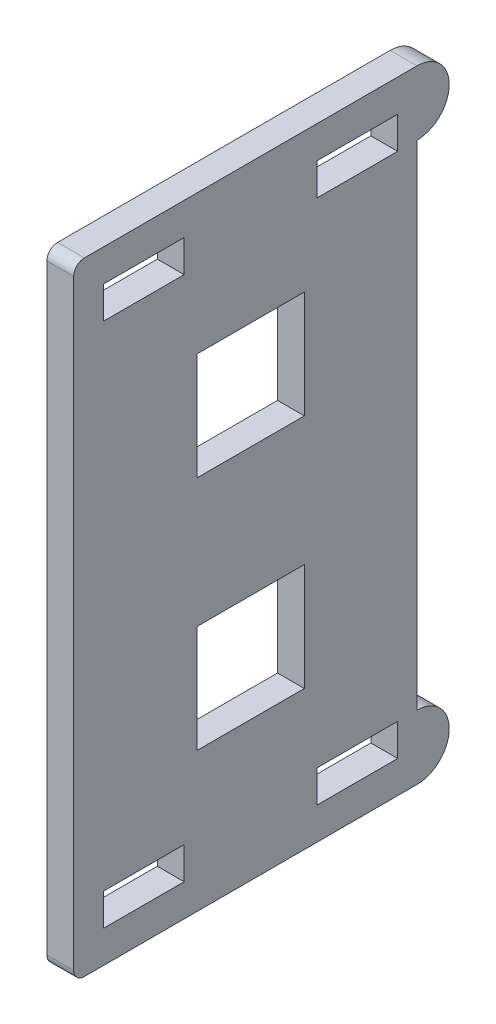
ISO-10303-21;
HEADER;
FILE_DESCRIPTION(('STEP AP214'),'2;1');
FILE_NAME('part.step','',(''),(''),'','','');
FILE_SCHEMA(('AUTOMOTIVE_DESIGN { 1 0 10303 214 1 1 1 1 }'));
ENDSEC;
DATA;
#1=APPLICATION_CONTEXT('core data for automotive mechanical design processes');
#2=APPLICATION_PROTOCOL_DEFINITION('international standard','automotive_design',2000,#1);
#3=PRODUCT_CONTEXT('',#1,'mechanical');
#4=PRODUCT('Part','Part','',(#3));
#5=PRODUCT_RELATED_PRODUCT_CATEGORY('part','',(#4));
#6=PRODUCT_DEFINITION_FORMATION('','',#4);
#7=PRODUCT_DEFINITION_CONTEXT('part definition',#1,'design');
#8=PRODUCT_DEFINITION('design','',#6,#7);
#9=PRODUCT_DEFINITION_SHAPE('','',#8);
#10=(LENGTH_UNIT() NAMED_UNIT(*) SI_UNIT(.MILLI.,.METRE.));
#11=(NAMED_UNIT(*) PLANE_ANGLE_UNIT() SI_UNIT($,.RADIAN.));
#12=(NAMED_UNIT(*) SI_UNIT($,.STERADIAN.) SOLID_ANGLE_UNIT());
#13=UNCERTAINTY_MEASURE_WITH_UNIT(LENGTH_MEASURE(1.E-05),#10,'distance_accuracy_value','');
#14=(GEOMETRIC_REPRESENTATION_CONTEXT(3) GLOBAL_UNCERTAINTY_ASSIGNED_CONTEXT((#13)) GLOBAL_UNIT_ASSIGNED_CONTEXT((#10,
#11,#12)) REPRESENTATION_CONTEXT('',''));
#15=CARTESIAN_POINT('',(0.,0.,0.));
#16=DIRECTION('',(0.,0.,1.));
#17=DIRECTION('',(1.,0.,0.));
#18=AXIS2_PLACEMENT_3D('',#15,#16,#17);
#19=CARTESIAN_POINT('',(2.5,0.,0.));
#20=DIRECTION('',(1.,0.,0.));
#21=DIRECTION('',(0.,0.,-1.));
#22=AXIS2_PLACEMENT_3D('',#19,#20,#21);
#23=PLANE('',#22);
#24=DIRECTION('',(0.,-1.,0.));
#25=VECTOR('',#24,1.);
#26=CARTESIAN_POINT('',(2.5,5.99999999999999,-4.00000000000002));
#27=LINE('',#26,#25);
#28=CARTESIAN_POINT('',(2.5,16.,-4.00000000000002));
#29=VERTEX_POINT('',#28);
#30=CARTESIAN_POINT('',(2.5,5.99999999999999,-4.00000000000002));
#31=VERTEX_POINT('',#30);
#32=EDGE_CURVE('E269',#29,#31,#27,.T.);
#33=ORIENTED_EDGE('',*,*,#32,.T.);
#34=DIRECTION('',(0.,0.,1.));
#35=VECTOR('',#34,1.);
#36=CARTESIAN_POINT('',(2.5,5.99999999999999,-4.00000000000002));
#37=LINE('',#36,#35);
#38=CARTESIAN_POINT('',(2.5,5.99999999999999,5.99999999999998));
#39=VERTEX_POINT('',#38);
#40=EDGE_CURVE('E281',#31,#39,#37,.T.);
#41=ORIENTED_EDGE('',*,*,#40,.T.);
#42=DIRECTION('',(0.,1.,0.));
#43=VECTOR('',#42,1.);
#44=CARTESIAN_POINT('',(2.5,5.99999999999999,5.99999999999998));
#45=LINE('',#44,#43);
#46=CARTESIAN_POINT('',(2.5,16.,5.99999999999997));
#47=VERTEX_POINT('',#46);
#48=EDGE_CURVE('E285',#39,#47,#45,.T.);
#49=ORIENTED_EDGE('',*,*,#48,.T.);
#50=DIRECTION('',(0.,0.,-1.));
#51=VECTOR('',#50,1.);
#52=CARTESIAN_POINT('',(2.5,16.,-4.00000000000002));
#53=LINE('',#52,#51);
#54=EDGE_CURVE('E277',#47,#29,#53,.T.);
#55=ORIENTED_EDGE('',*,*,#54,.T.);
#56=EDGE_LOOP('',(#33,#41,#49,#55));
#57=FACE_BOUND('',#56,.T.);
#58=DIRECTION('',(0.,-1.,0.));
#59=VECTOR('',#58,1.);
#60=CARTESIAN_POINT('',(2.5,-5.99999999999999,-4.00000000000002));
#61=LINE('',#60,#59);
#62=CARTESIAN_POINT('',(2.5,-5.99999999999999,-4.00000000000002));
#63=VERTEX_POINT('',#62);
#64=CARTESIAN_POINT('',(2.5,-16.,-4.00000000000002));
#65=VERTEX_POINT('',#64);
#66=EDGE_CURVE('E308',#63,#65,#61,.T.);
#67=ORIENTED_EDGE('',*,*,#66,.T.);
#68=DIRECTION('',(0.,0.,1.));
#69=VECTOR('',#68,1.);
#70=CARTESIAN_POINT('',(2.5,-16.,-4.00000000000002));
#71=LINE('',#70,#69);
#72=CARTESIAN_POINT('',(2.5,-16.,5.99999999999998));
#73=VERTEX_POINT('',#72);
#74=EDGE_CURVE('E311',#65,#73,#71,.T.);
#75=ORIENTED_EDGE('',*,*,#74,.T.);
#76=DIRECTION('',(0.,1.,0.));
#77=VECTOR('',#76,1.);
#78=CARTESIAN_POINT('',(2.5,-5.99999999999999,5.99999999999998));
#79=LINE('',#78,#77);
#80=CARTESIAN_POINT('',(2.5,-5.99999999999999,5.99999999999998));
#81=VERTEX_POINT('',#80);
#82=EDGE_CURVE('E315',#73,#81,#79,.T.);
#83=ORIENTED_EDGE('',*,*,#82,.T.);
#84=DIRECTION('',(0.,0.,-1.));
#85=VECTOR('',#84,1.);
#86=CARTESIAN_POINT('',(2.5,-5.99999999999999,-4.00000000000002));
#87=LINE('',#86,#85);
#88=EDGE_CURVE('E318',#81,#63,#87,.T.);
#89=ORIENTED_EDGE('',*,*,#88,.T.);
#90=EDGE_LOOP('',(#67,#75,#83,#89));
#91=FACE_BOUND('',#90,.T.);
#92=DIRECTION('',(0.,0.,-1.));
#93=VECTOR('',#92,1.);
#94=CARTESIAN_POINT('',(2.5,-23.,14.7));
#95=LINE('',#94,#93);
#96=CARTESIAN_POINT('',(2.5,-23.,14.7));
#97=VERTEX_POINT('',#96);
#98=CARTESIAN_POINT('',(2.5,-23.,7.20000000000001));
#99=VERTEX_POINT('',#98);
#100=EDGE_CURVE('E367',#97,#99,#95,.T.);
#101=ORIENTED_EDGE('',*,*,#100,.T.);
#102=DIRECTION('',(0.,-1.,0.));
#103=VECTOR('',#102,1.);
#104=CARTESIAN_POINT('',(2.5,-23.,7.20000000000001));
#105=LINE('',#104,#103);
#106=CARTESIAN_POINT('',(2.5,-26.,7.20000000000001));
#107=VERTEX_POINT('',#106);
#108=EDGE_CURVE('E370',#99,#107,#105,.T.);
#109=ORIENTED_EDGE('',*,*,#108,.T.);
#110=DIRECTION('',(0.,0.,1.));
#111=VECTOR('',#110,1.);
#112=CARTESIAN_POINT('',(2.5,-26.,7.20000000000001));
#113=LINE('',#112,#111);
#114=CARTESIAN_POINT('',(2.5,-26.,14.7));
#115=VERTEX_POINT('',#114);
#116=EDGE_CURVE('E374',#107,#115,#113,.T.);
#117=ORIENTED_EDGE('',*,*,#116,.T.);
#118=DIRECTION('',(0.,1.,0.));
#119=VECTOR('',#118,1.);
#120=CARTESIAN_POINT('',(2.5,-26.,14.7));
#121=LINE('',#120,#119);
#122=EDGE_CURVE('E377',#115,#97,#121,.T.);
#123=ORIENTED_EDGE('',*,*,#122,.T.);
#124=EDGE_LOOP('',(#101,#109,#117,#123));
#125=FACE_BOUND('',#124,.T.);
#126=DIRECTION('',(0.,0.,-1.));
#127=VECTOR('',#126,1.);
#128=CARTESIAN_POINT('',(2.5,-23.,-5.2));
#129=LINE('',#128,#127);
#130=CARTESIAN_POINT('',(2.5,-23.,-5.2));
#131=VERTEX_POINT('',#130);
#132=CARTESIAN_POINT('',(2.5,-23.,-12.7));
#133=VERTEX_POINT('',#132);
#134=EDGE_CURVE('E399',#131,#133,#129,.T.);
#135=ORIENTED_EDGE('',*,*,#134,.T.);
#136=DIRECTION('',(0.,-1.,0.));
#137=VECTOR('',#136,1.);
#138=CARTESIAN_POINT('',(2.5,-23.,-12.7));
#139=LINE('',#138,#137);
#140=CARTESIAN_POINT('',(2.5,-26.,-12.7));
#141=VERTEX_POINT('',#140);
#142=EDGE_CURVE('E402',#133,#141,#139,.T.);
#143=ORIENTED_EDGE('',*,*,#142,.T.);
#144=DIRECTION('',(0.,0.,1.));
#145=VECTOR('',#144,1.);
#146=CARTESIAN_POINT('',(2.5,-26.,-12.7));
#147=LINE('',#146,#145);
#148=CARTESIAN_POINT('',(2.5,-26.,-5.2));
#149=VERTEX_POINT('',#148);
#150=EDGE_CURVE('E406',#141,#149,#147,.T.);
#151=ORIENTED_EDGE('',*,*,#150,.T.);
#152=DIRECTION('',(0.,1.,0.));
#153=VECTOR('',#152,1.);
#154=CARTESIAN_POINT('',(2.5,-26.,-5.2));
#155=LINE('',#154,#153);
#156=EDGE_CURVE('E409',#149,#131,#155,.T.);
#157=ORIENTED_EDGE('',*,*,#156,.T.);
#158=EDGE_LOOP('',(#135,#143,#151,#157));
#159=FACE_BOUND('',#158,.T.);
#160=DIRECTION('',(0.,-1.,0.));
#161=VECTOR('',#160,1.);
#162=CARTESIAN_POINT('',(2.5,23.,7.2));
#163=LINE('',#162,#161);
#164=CARTESIAN_POINT('',(2.5,26.,7.2));
#165=VERTEX_POINT('',#164);
#166=CARTESIAN_POINT('',(2.5,23.,7.2));
#167=VERTEX_POINT('',#166);
#168=EDGE_CURVE('E431',#165,#167,#163,.T.);
#169=ORIENTED_EDGE('',*,*,#168,.T.);
#170=DIRECTION('',(0.,0.,1.));
#171=VECTOR('',#170,1.);
#172=CARTESIAN_POINT('',(2.5,23.,14.7));
#173=LINE('',#172,#171);
#174=CARTESIAN_POINT('',(2.5,23.,14.7));
#175=VERTEX_POINT('',#174);
#176=EDGE_CURVE('E434',#167,#175,#173,.T.);
#177=ORIENTED_EDGE('',*,*,#176,.T.);
#178=DIRECTION('',(0.,1.,0.));
#179=VECTOR('',#178,1.);
#180=CARTESIAN_POINT('',(2.5,26.,14.7));
#181=LINE('',#180,#179);
#182=CARTESIAN_POINT('',(2.5,26.,14.7));
#183=VERTEX_POINT('',#182);
#184=EDGE_CURVE('E438',#175,#183,#181,.T.);
#185=ORIENTED_EDGE('',*,*,#184,.T.);
#186=DIRECTION('',(0.,0.,-1.));
#187=VECTOR('',#186,1.);
#188=CARTESIAN_POINT('',(2.5,26.,7.2));
#189=LINE('',#188,#187);
#190=EDGE_CURVE('E441',#183,#165,#189,.T.);
#191=ORIENTED_EDGE('',*,*,#190,.T.);
#192=EDGE_LOOP('',(#169,#177,#185,#191));
#193=FACE_BOUND('',#192,.T.);
#194=DIRECTION('',(0.,-1.,0.));
#195=VECTOR('',#194,1.);
#196=CARTESIAN_POINT('',(2.5,23.,-12.7));
#197=LINE('',#196,#195);
#198=CARTESIAN_POINT('',(2.5,26.,-12.7));
#199=VERTEX_POINT('',#198);
#200=CARTESIAN_POINT('',(2.5,23.,-12.7));
#201=VERTEX_POINT('',#200);
#202=EDGE_CURVE('E463',#199,#201,#197,.T.);
#203=ORIENTED_EDGE('',*,*,#202,.T.);
#204=DIRECTION('',(0.,0.,1.));
#205=VECTOR('',#204,1.);
#206=CARTESIAN_POINT('',(2.5,23.,-5.20000000000001));
#207=LINE('',#206,#205);
#208=CARTESIAN_POINT('',(2.5,23.,-5.20000000000001));
#209=VERTEX_POINT('',#208);
#210=EDGE_CURVE('E466',#201,#209,#207,.T.);
#211=ORIENTED_EDGE('',*,*,#210,.T.);
#212=DIRECTION('',(0.,1.,0.));
#213=VECTOR('',#212,1.);
#214=CARTESIAN_POINT('',(2.5,26.,-5.20000000000001));
#215=LINE('',#214,#213);
#216=CARTESIAN_POINT('',(2.5,26.,-5.20000000000001));
#217=VERTEX_POINT('',#216);
#218=EDGE_CURVE('E470',#209,#217,#215,.T.);
#219=ORIENTED_EDGE('',*,*,#218,.T.);
#220=DIRECTION('',(0.,0.,-1.));
#221=VECTOR('',#220,1.);
#222=CARTESIAN_POINT('',(2.5,26.,-12.7));
#223=LINE('',#222,#221);
#224=EDGE_CURVE('E473',#217,#199,#223,.T.);
#225=ORIENTED_EDGE('',*,*,#224,.T.);
#226=EDGE_LOOP('',(#203,#211,#219,#225));
#227=FACE_BOUND('',#226,.T.);
#228=DIRECTION('',(0.,-1.,0.));
#229=VECTOR('',#228,1.);
#230=CARTESIAN_POINT('',(2.5,29.,17.5));
#231=LINE('',#230,#229);
#232=CARTESIAN_POINT('',(2.5,28.,17.5));
#233=VERTEX_POINT('',#232);
#234=CARTESIAN_POINT('',(2.5,-28.,17.5));
#235=VERTEX_POINT('',#234);
#236=EDGE_CURVE('E497',#233,#235,#231,.T.);
#237=ORIENTED_EDGE('',*,*,#236,.T.);
#238=CARTESIAN_POINT('',(2.5,-28.,16.5));
#239=DIRECTION('',(1.,0.,0.));
#240=DIRECTION('',(0.,0.,-1.));
#241=AXIS2_PLACEMENT_3D('',#238,#239,#240);
#242=CIRCLE('',#241,1.);
#243=CARTESIAN_POINT('',(2.5,-29.,16.5));
#244=VERTEX_POINT('',#243);
#245=EDGE_CURVE('E62',#235,#244,#242,.T.);
#246=ORIENTED_EDGE('',*,*,#245,.T.);
#247=DIRECTION('',(0.,0.,-1.));
#248=VECTOR('',#247,1.);
#249=CARTESIAN_POINT('',(2.5,-29.,17.5));
#250=LINE('',#249,#248);
#251=CARTESIAN_POINT('',(2.5,-29.,-14.5));
#252=VERTEX_POINT('',#251);
#253=EDGE_CURVE('E500',#244,#252,#250,.T.);
#254=ORIENTED_EDGE('',*,*,#253,.T.);
#255=CARTESIAN_POINT('',(2.5,-26.,-14.5));
#256=DIRECTION('',(-1.,0.,0.));
#257=DIRECTION('',(0.,0.,1.));
#258=AXIS2_PLACEMENT_3D('',#255,#256,#257);
#259=CIRCLE('',#258,2.99999999999999);
#260=CARTESIAN_POINT('',(2.5,-23.,-14.5));
#261=VERTEX_POINT('',#260);
#262=EDGE_CURVE('E348',#252,#261,#259,.F.);
#263=ORIENTED_EDGE('',*,*,#262,.T.);
#264=DIRECTION('',(0.,-1.,0.));
#265=VECTOR('',#264,1.);
#266=CARTESIAN_POINT('',(2.5,0.,-14.5));
#267=LINE('',#266,#265);
#268=CARTESIAN_POINT('',(2.5,23.,-14.5));
#269=VERTEX_POINT('',#268);
#270=EDGE_CURVE('E352',#269,#261,#267,.T.);
#271=ORIENTED_EDGE('',*,*,#270,.F.);
#272=CARTESIAN_POINT('',(2.5,26.,-14.5));
#273=DIRECTION('',(-1.,0.,0.));
#274=DIRECTION('',(0.,0.,1.));
#275=AXIS2_PLACEMENT_3D('',#272,#273,#274);
#276=CIRCLE('',#275,2.99999999999999);
#277=CARTESIAN_POINT('',(2.5,29.,-14.5));
#278=VERTEX_POINT('',#277);
#279=EDGE_CURVE('E346',#278,#269,#276,.T.);
#280=ORIENTED_EDGE('',*,*,#279,.F.);
#281=DIRECTION('',(0.,0.,1.));
#282=VECTOR('',#281,1.);
#283=CARTESIAN_POINT('',(2.5,29.,17.5));
#284=LINE('',#283,#282);
#285=CARTESIAN_POINT('',(2.5,29.,16.5));
#286=VERTEX_POINT('',#285);
#287=EDGE_CURVE('E495',#278,#286,#284,.T.);
#288=ORIENTED_EDGE('',*,*,#287,.T.);
#289=CARTESIAN_POINT('',(2.5,28.,16.5));
#290=DIRECTION('',(1.,0.,0.));
#291=DIRECTION('',(0.,0.,-1.));
#292=AXIS2_PLACEMENT_3D('',#289,#290,#291);
#293=CIRCLE('',#292,1.);
#294=EDGE_CURVE('E517',#286,#233,#293,.T.);
#295=ORIENTED_EDGE('',*,*,#294,.T.);
#296=EDGE_LOOP('',(#237,#246,#254,#263,#271,#280,#288,#295));
#297=FACE_BOUND('',#296,.T.);
#298=ADVANCED_FACE('F54',(#57,#91,#125,#159,#193,#227,#297),#23,.T.);
#299=CARTESIAN_POINT('',(0.,0.,0.));
#300=DIRECTION('',(1.,0.,0.));
#301=DIRECTION('',(0.,0.,-1.));
#302=AXIS2_PLACEMENT_3D('',#299,#300,#301);
#303=PLANE('',#302);
#304=DIRECTION('',(0.,0.,1.));
#305=VECTOR('',#304,1.);
#306=CARTESIAN_POINT('',(0.,5.99999999999999,-4.00000000000002));
#307=LINE('',#306,#305);
#308=CARTESIAN_POINT('',(0.,5.99999999999999,-4.00000000000002));
#309=VERTEX_POINT('',#308);
#310=CARTESIAN_POINT('',(0.,5.99999999999999,5.99999999999998));
#311=VERTEX_POINT('',#310);
#312=EDGE_CURVE('E298',#309,#311,#307,.T.);
#313=ORIENTED_EDGE('',*,*,#312,.F.);
#314=DIRECTION('',(0.,-1.,0.));
#315=VECTOR('',#314,1.);
#316=CARTESIAN_POINT('',(0.,5.99999999999999,-4.00000000000002));
#317=LINE('',#316,#315);
#318=CARTESIAN_POINT('',(0.,16.,-4.00000000000002));
#319=VERTEX_POINT('',#318);
#320=EDGE_CURVE('E272',#319,#309,#317,.T.);
#321=ORIENTED_EDGE('',*,*,#320,.F.);
#322=DIRECTION('',(0.,0.,-1.));
#323=VECTOR('',#322,1.);
#324=CARTESIAN_POINT('',(0.,16.,-4.00000000000002));
#325=LINE('',#324,#323);
#326=CARTESIAN_POINT('',(0.,16.,5.99999999999997));
#327=VERTEX_POINT('',#326);
#328=EDGE_CURVE('E289',#327,#319,#325,.T.);
#329=ORIENTED_EDGE('',*,*,#328,.F.);
#330=DIRECTION('',(0.,1.,0.));
#331=VECTOR('',#330,1.);
#332=CARTESIAN_POINT('',(0.,5.99999999999999,5.99999999999998));
#333=LINE('',#332,#331);
#334=EDGE_CURVE('E292',#311,#327,#333,.T.);
#335=ORIENTED_EDGE('',*,*,#334,.F.);
#336=EDGE_LOOP('',(#313,#321,#329,#335));
#337=FACE_BOUND('',#336,.T.);
#338=DIRECTION('',(0.,0.,1.));
#339=VECTOR('',#338,1.);
#340=CARTESIAN_POINT('',(0.,-16.,-4.00000000000002));
#341=LINE('',#340,#339);
#342=CARTESIAN_POINT('',(0.,-16.,-4.00000000000002));
#343=VERTEX_POINT('',#342);
#344=CARTESIAN_POINT('',(0.,-16.,5.99999999999998));
#345=VERTEX_POINT('',#344);
#346=EDGE_CURVE('E323',#343,#345,#341,.T.);
#347=ORIENTED_EDGE('',*,*,#346,.F.);
#348=DIRECTION('',(0.,-1.,0.));
#349=VECTOR('',#348,1.);
#350=CARTESIAN_POINT('',(0.,-5.99999999999999,-4.00000000000002));
#351=LINE('',#350,#349);
#352=CARTESIAN_POINT('',(0.,-5.99999999999999,-4.00000000000002));
#353=VERTEX_POINT('',#352);
#354=EDGE_CURVE('E304',#353,#343,#351,.T.);
#355=ORIENTED_EDGE('',*,*,#354,.F.);
#356=DIRECTION('',(0.,0.,-1.));
#357=VECTOR('',#356,1.);
#358=CARTESIAN_POINT('',(0.,-5.99999999999999,-4.00000000000002));
#359=LINE('',#358,#357);
#360=CARTESIAN_POINT('',(0.,-5.99999999999999,5.99999999999998));
#361=VERTEX_POINT('',#360);
#362=EDGE_CURVE('E312',#361,#353,#359,.T.);
#363=ORIENTED_EDGE('',*,*,#362,.F.);
#364=DIRECTION('',(0.,1.,0.));
#365=VECTOR('',#364,1.);
#366=CARTESIAN_POINT('',(0.,-5.99999999999999,5.99999999999998));
#367=LINE('',#366,#365);
#368=EDGE_CURVE('E326',#345,#361,#367,.T.);
#369=ORIENTED_EDGE('',*,*,#368,.F.);
#370=EDGE_LOOP('',(#347,#355,#363,#369));
#371=FACE_BOUND('',#370,.T.);
#372=DIRECTION('',(0.,-1.,0.));
#373=VECTOR('',#372,1.);
#374=CARTESIAN_POINT('',(0.,-23.,7.20000000000001));
#375=LINE('',#374,#373);
#376=CARTESIAN_POINT('',(0.,-23.,7.20000000000001));
#377=VERTEX_POINT('',#376);
#378=CARTESIAN_POINT('',(0.,-26.,7.20000000000001));
#379=VERTEX_POINT('',#378);
#380=EDGE_CURVE('E382',#377,#379,#375,.T.);
#381=ORIENTED_EDGE('',*,*,#380,.F.);
#382=DIRECTION('',(0.,0.,-1.));
#383=VECTOR('',#382,1.);
#384=CARTESIAN_POINT('',(0.,-23.,14.7));
#385=LINE('',#384,#383);
#386=CARTESIAN_POINT('',(0.,-23.,14.7));
#387=VERTEX_POINT('',#386);
#388=EDGE_CURVE('E365',#387,#377,#385,.T.);
#389=ORIENTED_EDGE('',*,*,#388,.F.);
#390=DIRECTION('',(0.,1.,0.));
#391=VECTOR('',#390,1.);
#392=CARTESIAN_POINT('',(0.,-26.,14.7));
#393=LINE('',#392,#391);
#394=CARTESIAN_POINT('',(0.,-26.,14.7));
#395=VERTEX_POINT('',#394);
#396=EDGE_CURVE('E371',#395,#387,#393,.T.);
#397=ORIENTED_EDGE('',*,*,#396,.F.);
#398=DIRECTION('',(0.,0.,1.));
#399=VECTOR('',#398,1.);
#400=CARTESIAN_POINT('',(0.,-26.,7.20000000000001));
#401=LINE('',#400,#399);
#402=EDGE_CURVE('E385',#379,#395,#401,.T.);
#403=ORIENTED_EDGE('',*,*,#402,.F.);
#404=EDGE_LOOP('',(#381,#389,#397,#403));
#405=FACE_BOUND('',#404,.T.);
#406=DIRECTION('',(0.,-1.,0.));
#407=VECTOR('',#406,1.);
#408=CARTESIAN_POINT('',(0.,-23.,-12.7));
#409=LINE('',#408,#407);
#410=CARTESIAN_POINT('',(0.,-23.,-12.7));
#411=VERTEX_POINT('',#410);
#412=CARTESIAN_POINT('',(0.,-26.,-12.7));
#413=VERTEX_POINT('',#412);
#414=EDGE_CURVE('E414',#411,#413,#409,.T.);
#415=ORIENTED_EDGE('',*,*,#414,.F.);
#416=DIRECTION('',(0.,0.,-1.));
#417=VECTOR('',#416,1.);
#418=CARTESIAN_POINT('',(0.,-23.,-5.2));
#419=LINE('',#418,#417);
#420=CARTESIAN_POINT('',(0.,-23.,-5.2));
#421=VERTEX_POINT('',#420);
#422=EDGE_CURVE('E392',#421,#411,#419,.T.);
#423=ORIENTED_EDGE('',*,*,#422,.F.);
#424=DIRECTION('',(0.,1.,0.));
#425=VECTOR('',#424,1.);
#426=CARTESIAN_POINT('',(0.,-26.,-5.2));
#427=LINE('',#426,#425);
#428=CARTESIAN_POINT('',(0.,-26.,-5.2));
#429=VERTEX_POINT('',#428);
#430=EDGE_CURVE('E403',#429,#421,#427,.T.);
#431=ORIENTED_EDGE('',*,*,#430,.F.);
#432=DIRECTION('',(0.,0.,1.));
#433=VECTOR('',#432,1.);
#434=CARTESIAN_POINT('',(0.,-26.,-12.7));
#435=LINE('',#434,#433);
#436=EDGE_CURVE('E417',#413,#429,#435,.T.);
#437=ORIENTED_EDGE('',*,*,#436,.F.);
#438=EDGE_LOOP('',(#415,#423,#431,#437));
#439=FACE_BOUND('',#438,.T.);
#440=DIRECTION('',(0.,0.,1.));
#441=VECTOR('',#440,1.);
#442=CARTESIAN_POINT('',(0.,23.,14.7));
#443=LINE('',#442,#441);
#444=CARTESIAN_POINT('',(0.,23.,7.2));
#445=VERTEX_POINT('',#444);
#446=CARTESIAN_POINT('',(0.,23.,14.7));
#447=VERTEX_POINT('',#446);
#448=EDGE_CURVE('E446',#445,#447,#443,.T.);
#449=ORIENTED_EDGE('',*,*,#448,.F.);
#450=DIRECTION('',(0.,-1.,0.));
#451=VECTOR('',#450,1.);
#452=CARTESIAN_POINT('',(0.,23.,7.2));
#453=LINE('',#452,#451);
#454=CARTESIAN_POINT('',(0.,26.,7.2));
#455=VERTEX_POINT('',#454);
#456=EDGE_CURVE('E424',#455,#445,#453,.T.);
#457=ORIENTED_EDGE('',*,*,#456,.F.);
#458=DIRECTION('',(0.,0.,-1.));
#459=VECTOR('',#458,1.);
#460=CARTESIAN_POINT('',(0.,26.,7.2));
#461=LINE('',#460,#459);
#462=CARTESIAN_POINT('',(0.,26.,14.7));
#463=VERTEX_POINT('',#462);
#464=EDGE_CURVE('E435',#463,#455,#461,.T.);
#465=ORIENTED_EDGE('',*,*,#464,.F.);
#466=DIRECTION('',(0.,1.,0.));
#467=VECTOR('',#466,1.);
#468=CARTESIAN_POINT('',(0.,26.,14.7));
#469=LINE('',#468,#467);
#470=EDGE_CURVE('E449',#447,#463,#469,.T.);
#471=ORIENTED_EDGE('',*,*,#470,.F.);
#472=EDGE_LOOP('',(#449,#457,#465,#471));
#473=FACE_BOUND('',#472,.T.);
#474=DIRECTION('',(0.,0.,1.));
#475=VECTOR('',#474,1.);
#476=CARTESIAN_POINT('',(0.,23.,-5.20000000000001));
#477=LINE('',#476,#475);
#478=CARTESIAN_POINT('',(0.,23.,-12.7));
#479=VERTEX_POINT('',#478);
#480=CARTESIAN_POINT('',(0.,23.,-5.20000000000001));
#481=VERTEX_POINT('',#480);
#482=EDGE_CURVE('E478',#479,#481,#477,.T.);
#483=ORIENTED_EDGE('',*,*,#482,.F.);
#484=DIRECTION('',(0.,-1.,0.));
#485=VECTOR('',#484,1.);
#486=CARTESIAN_POINT('',(0.,23.,-12.7));
#487=LINE('',#486,#485);
#488=CARTESIAN_POINT('',(0.,26.,-12.7));
#489=VERTEX_POINT('',#488);
#490=EDGE_CURVE('E456',#489,#479,#487,.T.);
#491=ORIENTED_EDGE('',*,*,#490,.F.);
#492=DIRECTION('',(0.,0.,-1.));
#493=VECTOR('',#492,1.);
#494=CARTESIAN_POINT('',(0.,26.,-12.7));
#495=LINE('',#494,#493);
#496=CARTESIAN_POINT('',(0.,26.,-5.20000000000001));
#497=VERTEX_POINT('',#496);
#498=EDGE_CURVE('E467',#497,#489,#495,.T.);
#499=ORIENTED_EDGE('',*,*,#498,.F.);
#500=DIRECTION('',(0.,1.,0.));
#501=VECTOR('',#500,1.);
#502=CARTESIAN_POINT('',(0.,26.,-5.20000000000001));
#503=LINE('',#502,#501);
#504=EDGE_CURVE('E481',#481,#497,#503,.T.);
#505=ORIENTED_EDGE('',*,*,#504,.F.);
#506=EDGE_LOOP('',(#483,#491,#499,#505));
#507=FACE_BOUND('',#506,.T.);
#508=DIRECTION('',(0.,0.,-1.));
#509=VECTOR('',#508,1.);
#510=CARTESIAN_POINT('',(0.,-29.,17.5));
#511=LINE('',#510,#509);
#512=CARTESIAN_POINT('',(0.,-29.,16.5));
#513=VERTEX_POINT('',#512);
#514=CARTESIAN_POINT('',(0.,-29.,-14.5));
#515=VERTEX_POINT('',#514);
#516=EDGE_CURVE('E498',#513,#515,#511,.T.);
#517=ORIENTED_EDGE('',*,*,#516,.F.);
#518=CARTESIAN_POINT('',(0.,-28.,16.5));
#519=DIRECTION('',(1.,0.,0.));
#520=DIRECTION('',(0.,0.,-1.));
#521=AXIS2_PLACEMENT_3D('',#518,#519,#520);
#522=CIRCLE('',#521,1.);
#523=CARTESIAN_POINT('',(0.,-28.,17.5));
#524=VERTEX_POINT('',#523);
#525=EDGE_CURVE('E511',#513,#524,#522,.F.);
#526=ORIENTED_EDGE('',*,*,#525,.T.);
#527=DIRECTION('',(0.,-1.,0.));
#528=VECTOR('',#527,1.);
#529=CARTESIAN_POINT('',(0.,29.,17.5));
#530=LINE('',#529,#528);
#531=CARTESIAN_POINT('',(0.,28.,17.5));
#532=VERTEX_POINT('',#531);
#533=EDGE_CURVE('E504',#532,#524,#530,.T.);
#534=ORIENTED_EDGE('',*,*,#533,.F.);
#535=CARTESIAN_POINT('',(0.,28.,16.5));
#536=DIRECTION('',(1.,0.,0.));
#537=DIRECTION('',(0.,0.,-1.));
#538=AXIS2_PLACEMENT_3D('',#535,#536,#537);
#539=CIRCLE('',#538,1.);
#540=CARTESIAN_POINT('',(0.,29.,16.5));
#541=VERTEX_POINT('',#540);
#542=EDGE_CURVE('E509',#532,#541,#539,.F.);
#543=ORIENTED_EDGE('',*,*,#542,.T.);
#544=DIRECTION('',(0.,0.,1.));
#545=VECTOR('',#544,1.);
#546=CARTESIAN_POINT('',(0.,29.,17.5));
#547=LINE('',#546,#545);
#548=CARTESIAN_POINT('',(0.,29.,-14.5));
#549=VERTEX_POINT('',#548);
#550=EDGE_CURVE('E488',#549,#541,#547,.T.);
#551=ORIENTED_EDGE('',*,*,#550,.F.);
#552=CARTESIAN_POINT('',(0.,26.,-14.5));
#553=DIRECTION('',(-1.,0.,0.));
#554=DIRECTION('',(0.,0.,1.));
#555=AXIS2_PLACEMENT_3D('',#552,#553,#554);
#556=CIRCLE('',#555,2.99999999999999);
#557=CARTESIAN_POINT('',(0.,23.,-14.5));
#558=VERTEX_POINT('',#557);
#559=EDGE_CURVE('E345',#549,#558,#556,.T.);
#560=ORIENTED_EDGE('',*,*,#559,.T.);
#561=DIRECTION('',(0.,-1.,0.));
#562=VECTOR('',#561,1.);
#563=CARTESIAN_POINT('',(0.,0.,-14.5));
#564=LINE('',#563,#562);
#565=CARTESIAN_POINT('',(0.,-23.,-14.5));
#566=VERTEX_POINT('',#565);
#567=EDGE_CURVE('E349',#558,#566,#564,.T.);
#568=ORIENTED_EDGE('',*,*,#567,.T.);
#569=CARTESIAN_POINT('',(0.,-26.,-14.5));
#570=DIRECTION('',(-1.,0.,0.));
#571=DIRECTION('',(0.,0.,1.));
#572=AXIS2_PLACEMENT_3D('',#569,#570,#571);
#573=CIRCLE('',#572,2.99999999999999);
#574=EDGE_CURVE('E357',#515,#566,#573,.F.);
#575=ORIENTED_EDGE('',*,*,#574,.F.);
#576=EDGE_LOOP('',(#517,#526,#534,#543,#551,#560,#568,#575));
#577=FACE_BOUND('',#576,.T.);
#578=ADVANCED_FACE('F531',(#337,#371,#405,#439,#473,#507,#577),#303,.F.);
#579=CARTESIAN_POINT('',(2.5,29.,17.5));
#580=DIRECTION('',(0.,-1.,0.));
#581=DIRECTION('',(0.,0.,-1.));
#582=AXIS2_PLACEMENT_3D('',#579,#580,#581);
#583=PLANE('',#582);
#584=ORIENTED_EDGE('',*,*,#550,.T.);
#585=DIRECTION('',(-1.,0.,0.));
#586=VECTOR('',#585,1.);
#587=CARTESIAN_POINT('',(2.5,29.,16.5));
#588=LINE('',#587,#586);
#589=EDGE_CURVE('E12',#541,#286,#588,.F.);
#590=ORIENTED_EDGE('',*,*,#589,.T.);
#591=ORIENTED_EDGE('',*,*,#287,.F.);
#592=DIRECTION('',(-1.,0.,0.));
#593=VECTOR('',#592,1.);
#594=CARTESIAN_POINT('',(2.5,29.,-14.5));
#595=LINE('',#594,#593);
#596=EDGE_CURVE('E333',#278,#549,#595,.T.);
#597=ORIENTED_EDGE('',*,*,#596,.T.);
#598=EDGE_LOOP('',(#584,#590,#591,#597));
#599=FACE_BOUND('',#598,.T.);
#600=ADVANCED_FACE('F538',(#599),#583,.F.);
#601=CARTESIAN_POINT('',(2.5,29.,17.5));
#602=DIRECTION('',(0.,0.,-1.));
#603=DIRECTION('',(0.,1.,0.));
#604=AXIS2_PLACEMENT_3D('',#601,#602,#603);
#605=PLANE('',#604);
#606=ORIENTED_EDGE('',*,*,#533,.T.);
#607=DIRECTION('',(-1.,0.,0.));
#608=VECTOR('',#607,1.);
#609=CARTESIAN_POINT('',(2.5,-28.,17.5));
#610=LINE('',#609,#608);
#611=EDGE_CURVE('E75',#524,#235,#610,.F.);
#612=ORIENTED_EDGE('',*,*,#611,.T.);
#613=ORIENTED_EDGE('',*,*,#236,.F.);
#614=DIRECTION('',(-1.,0.,0.));
#615=VECTOR('',#614,1.);
#616=CARTESIAN_POINT('',(2.5,28.,17.5));
#617=LINE('',#616,#615);
#618=EDGE_CURVE('E513',#233,#532,#617,.T.);
#619=ORIENTED_EDGE('',*,*,#618,.T.);
#620=EDGE_LOOP('',(#606,#612,#613,#619));
#621=FACE_BOUND('',#620,.T.);
#622=ADVANCED_FACE('F533',(#621),#605,.F.);
#623=CARTESIAN_POINT('',(2.5,-29.,17.5));
#624=DIRECTION('',(0.,1.,0.));
#625=DIRECTION('',(0.,0.,1.));
#626=AXIS2_PLACEMENT_3D('',#623,#624,#625);
#627=PLANE('',#626);
#628=ORIENTED_EDGE('',*,*,#253,.F.);
#629=DIRECTION('',(-1.,0.,0.));
#630=VECTOR('',#629,1.);
#631=CARTESIAN_POINT('',(2.5,-29.,16.5));
#632=LINE('',#631,#630);
#633=EDGE_CURVE('E502',#244,#513,#632,.T.);
#634=ORIENTED_EDGE('',*,*,#633,.T.);
#635=ORIENTED_EDGE('',*,*,#516,.T.);
#636=DIRECTION('',(-1.,0.,0.));
#637=VECTOR('',#636,1.);
#638=CARTESIAN_POINT('',(2.5,-29.,-14.5));
#639=LINE('',#638,#637);
#640=EDGE_CURVE('E342',#252,#515,#639,.T.);
#641=ORIENTED_EDGE('',*,*,#640,.F.);
#642=EDGE_LOOP('',(#628,#634,#635,#641));
#643=FACE_BOUND('',#642,.T.);
#644=ADVANCED_FACE('F526',(#643),#627,.F.);
#645=CARTESIAN_POINT('',(2.5,23.,-12.7));
#646=DIRECTION('',(0.,0.,-1.));
#647=DIRECTION('',(-1.,0.,0.));
#648=AXIS2_PLACEMENT_3D('',#645,#646,#647);
#649=PLANE('',#648);
#650=ORIENTED_EDGE('',*,*,#490,.T.);
#651=DIRECTION('',(-1.,0.,0.));
#652=VECTOR('',#651,1.);
#653=CARTESIAN_POINT('',(2.5,23.,-12.7));
#654=LINE('',#653,#652);
#655=EDGE_CURVE('E476',#201,#479,#654,.T.);
#656=ORIENTED_EDGE('',*,*,#655,.F.);
#657=ORIENTED_EDGE('',*,*,#202,.F.);
#658=DIRECTION('',(-1.,0.,0.));
#659=VECTOR('',#658,1.);
#660=CARTESIAN_POINT('',(2.5,26.,-12.7));
#661=LINE('',#660,#659);
#662=EDGE_CURVE('E486',#199,#489,#661,.T.);
#663=ORIENTED_EDGE('',*,*,#662,.T.);
#664=EDGE_LOOP('',(#650,#656,#657,#663));
#665=FACE_BOUND('',#664,.T.);
#666=ADVANCED_FACE('F574',(#665),#649,.F.);
#667=CARTESIAN_POINT('',(2.5,26.,-12.7));
#668=DIRECTION('',(0.,1.,0.));
#669=DIRECTION('',(0.,0.,1.));
#670=AXIS2_PLACEMENT_3D('',#667,#668,#669);
#671=PLANE('',#670);
#672=ORIENTED_EDGE('',*,*,#498,.T.);
#673=ORIENTED_EDGE('',*,*,#662,.F.);
#674=ORIENTED_EDGE('',*,*,#224,.F.);
#675=DIRECTION('',(-1.,0.,0.));
#676=VECTOR('',#675,1.);
#677=CARTESIAN_POINT('',(2.5,26.,-5.20000000000001));
#678=LINE('',#677,#676);
#679=EDGE_CURVE('E489',#217,#497,#678,.T.);
#680=ORIENTED_EDGE('',*,*,#679,.T.);
#681=EDGE_LOOP('',(#672,#673,#674,#680));
#682=FACE_BOUND('',#681,.T.);
#683=ADVANCED_FACE('F642',(#682),#671,.F.);
#684=CARTESIAN_POINT('',(2.5,26.,-5.20000000000001));
#685=DIRECTION('',(0.,0.,1.));
#686=DIRECTION('',(1.,0.,0.));
#687=AXIS2_PLACEMENT_3D('',#684,#685,#686);
#688=PLANE('',#687);
#689=ORIENTED_EDGE('',*,*,#504,.T.);
#690=ORIENTED_EDGE('',*,*,#679,.F.);
#691=ORIENTED_EDGE('',*,*,#218,.F.);
#692=DIRECTION('',(-1.,0.,0.));
#693=VECTOR('',#692,1.);
#694=CARTESIAN_POINT('',(2.5,23.,-5.20000000000001));
#695=LINE('',#694,#693);
#696=EDGE_CURVE('E491',#209,#481,#695,.T.);
#697=ORIENTED_EDGE('',*,*,#696,.T.);
#698=EDGE_LOOP('',(#689,#690,#691,#697));
#699=FACE_BOUND('',#698,.T.);
#700=ADVANCED_FACE('F639',(#699),#688,.F.);
#701=CARTESIAN_POINT('',(2.5,23.,-5.20000000000001));
#702=DIRECTION('',(0.,-1.,0.));
#703=DIRECTION('',(0.,0.,-1.));
#704=AXIS2_PLACEMENT_3D('',#701,#702,#703);
#705=PLANE('',#704);
#706=ORIENTED_EDGE('',*,*,#482,.T.);
#707=ORIENTED_EDGE('',*,*,#696,.F.);
#708=ORIENTED_EDGE('',*,*,#210,.F.);
#709=ORIENTED_EDGE('',*,*,#655,.T.);
#710=EDGE_LOOP('',(#706,#707,#708,#709));
#711=FACE_BOUND('',#710,.T.);
#712=ADVANCED_FACE('F636',(#711),#705,.F.);
#713=CARTESIAN_POINT('',(2.5,23.,7.2));
#714=DIRECTION('',(0.,0.,-1.));
#715=DIRECTION('',(0.,1.,0.));
#716=AXIS2_PLACEMENT_3D('',#713,#714,#715);
#717=PLANE('',#716);
#718=ORIENTED_EDGE('',*,*,#456,.T.);
#719=DIRECTION('',(-1.,0.,0.));
#720=VECTOR('',#719,1.);
#721=CARTESIAN_POINT('',(2.5,23.,7.2));
#722=LINE('',#721,#720);
#723=EDGE_CURVE('E444',#167,#445,#722,.T.);
#724=ORIENTED_EDGE('',*,*,#723,.F.);
#725=ORIENTED_EDGE('',*,*,#168,.F.);
#726=DIRECTION('',(-1.,0.,0.));
#727=VECTOR('',#726,1.);
#728=CARTESIAN_POINT('',(2.5,26.,7.2));
#729=LINE('',#728,#727);
#730=EDGE_CURVE('E454',#165,#455,#729,.T.);
#731=ORIENTED_EDGE('',*,*,#730,.T.);
#732=EDGE_LOOP('',(#718,#724,#725,#731));
#733=FACE_BOUND('',#732,.T.);
#734=ADVANCED_FACE('F652',(#733),#717,.F.);
#735=CARTESIAN_POINT('',(2.5,26.,7.2));
#736=DIRECTION('',(0.,1.,0.));
#737=DIRECTION('',(0.,0.,1.));
#738=AXIS2_PLACEMENT_3D('',#735,#736,#737);
#739=PLANE('',#738);
#740=ORIENTED_EDGE('',*,*,#464,.T.);
#741=ORIENTED_EDGE('',*,*,#730,.F.);
#742=ORIENTED_EDGE('',*,*,#190,.F.);
#743=DIRECTION('',(-1.,0.,0.));
#744=VECTOR('',#743,1.);
#745=CARTESIAN_POINT('',(2.5,26.,14.7));
#746=LINE('',#745,#744);
#747=EDGE_CURVE('E457',#183,#463,#746,.T.);
#748=ORIENTED_EDGE('',*,*,#747,.T.);
#749=EDGE_LOOP('',(#740,#741,#742,#748));
#750=FACE_BOUND('',#749,.T.);
#751=ADVANCED_FACE('F658',(#750),#739,.F.);
#752=CARTESIAN_POINT('',(2.5,26.,14.7));
#753=DIRECTION('',(0.,0.,1.));
#754=DIRECTION('',(1.,0.,0.));
#755=AXIS2_PLACEMENT_3D('',#752,#753,#754);
#756=PLANE('',#755);
#757=ORIENTED_EDGE('',*,*,#470,.T.);
#758=ORIENTED_EDGE('',*,*,#747,.F.);
#759=ORIENTED_EDGE('',*,*,#184,.F.);
#760=DIRECTION('',(-1.,0.,0.));
#761=VECTOR('',#760,1.);
#762=CARTESIAN_POINT('',(2.5,23.,14.7));
#763=LINE('',#762,#761);
#764=EDGE_CURVE('E459',#175,#447,#763,.T.);
#765=ORIENTED_EDGE('',*,*,#764,.T.);
#766=EDGE_LOOP('',(#757,#758,#759,#765));
#767=FACE_BOUND('',#766,.T.);
#768=ADVANCED_FACE('F663',(#767),#756,.F.);
#769=CARTESIAN_POINT('',(2.5,23.,14.7));
#770=DIRECTION('',(0.,-1.,0.));
#771=DIRECTION('',(0.,0.,-1.));
#772=AXIS2_PLACEMENT_3D('',#769,#770,#771);
#773=PLANE('',#772);
#774=ORIENTED_EDGE('',*,*,#448,.T.);
#775=ORIENTED_EDGE('',*,*,#764,.F.);
#776=ORIENTED_EDGE('',*,*,#176,.F.);
#777=ORIENTED_EDGE('',*,*,#723,.T.);
#778=EDGE_LOOP('',(#774,#775,#776,#777));
#779=FACE_BOUND('',#778,.T.);
#780=ADVANCED_FACE('F672',(#779),#773,.F.);
#781=CARTESIAN_POINT('',(2.5,-23.,-5.2));
#782=DIRECTION('',(0.,1.,0.));
#783=DIRECTION('',(0.,0.,1.));
#784=AXIS2_PLACEMENT_3D('',#781,#782,#783);
#785=PLANE('',#784);
#786=ORIENTED_EDGE('',*,*,#422,.T.);
#787=DIRECTION('',(-1.,0.,0.));
#788=VECTOR('',#787,1.);
#789=CARTESIAN_POINT('',(2.5,-23.,-12.7));
#790=LINE('',#789,#788);
#791=EDGE_CURVE('E412',#133,#411,#790,.T.);
#792=ORIENTED_EDGE('',*,*,#791,.F.);
#793=ORIENTED_EDGE('',*,*,#134,.F.);
#794=DIRECTION('',(-1.,0.,0.));
#795=VECTOR('',#794,1.);
#796=CARTESIAN_POINT('',(2.5,-23.,-5.2));
#797=LINE('',#796,#795);
#798=EDGE_CURVE('E422',#131,#421,#797,.T.);
#799=ORIENTED_EDGE('',*,*,#798,.T.);
#800=EDGE_LOOP('',(#786,#792,#793,#799));
#801=FACE_BOUND('',#800,.T.);
#802=ADVANCED_FACE('F682',(#801),#785,.F.);
#803=CARTESIAN_POINT('',(2.5,-26.,-5.2));
#804=DIRECTION('',(0.,0.,1.));
#805=DIRECTION('',(0.,-1.,0.));
#806=AXIS2_PLACEMENT_3D('',#803,#804,#805);
#807=PLANE('',#806);
#808=ORIENTED_EDGE('',*,*,#430,.T.);
#809=ORIENTED_EDGE('',*,*,#798,.F.);
#810=ORIENTED_EDGE('',*,*,#156,.F.);
#811=DIRECTION('',(-1.,0.,0.));
#812=VECTOR('',#811,1.);
#813=CARTESIAN_POINT('',(2.5,-26.,-5.2));
#814=LINE('',#813,#812);
#815=EDGE_CURVE('E425',#149,#429,#814,.T.);
#816=ORIENTED_EDGE('',*,*,#815,.T.);
#817=EDGE_LOOP('',(#808,#809,#810,#816));
#818=FACE_BOUND('',#817,.T.);
#819=ADVANCED_FACE('F686',(#818),#807,.F.);
#820=CARTESIAN_POINT('',(2.5,-26.,-12.7));
#821=DIRECTION('',(0.,-1.,0.));
#822=DIRECTION('',(0.,0.,-1.));
#823=AXIS2_PLACEMENT_3D('',#820,#821,#822);
#824=PLANE('',#823);
#825=ORIENTED_EDGE('',*,*,#436,.T.);
#826=ORIENTED_EDGE('',*,*,#815,.F.);
#827=ORIENTED_EDGE('',*,*,#150,.F.);
#828=DIRECTION('',(-1.,0.,0.));
#829=VECTOR('',#828,1.);
#830=CARTESIAN_POINT('',(2.5,-26.,-12.7));
#831=LINE('',#830,#829);
#832=EDGE_CURVE('E427',#141,#413,#831,.T.);
#833=ORIENTED_EDGE('',*,*,#832,.T.);
#834=EDGE_LOOP('',(#825,#826,#827,#833));
#835=FACE_BOUND('',#834,.T.);
#836=ADVANCED_FACE('F692',(#835),#824,.F.);
#837=CARTESIAN_POINT('',(2.5,-23.,-12.7));
#838=DIRECTION('',(0.,0.,-1.));
#839=DIRECTION('',(0.,1.,0.));
#840=AXIS2_PLACEMENT_3D('',#837,#838,#839);
#841=PLANE('',#840);
#842=ORIENTED_EDGE('',*,*,#414,.T.);
#843=ORIENTED_EDGE('',*,*,#832,.F.);
#844=ORIENTED_EDGE('',*,*,#142,.F.);
#845=ORIENTED_EDGE('',*,*,#791,.T.);
#846=EDGE_LOOP('',(#842,#843,#844,#845));
#847=FACE_BOUND('',#846,.T.);
#848=ADVANCED_FACE('F688',(#847),#841,.F.);
#849=CARTESIAN_POINT('',(2.5,-23.,14.7));
#850=DIRECTION('',(0.,1.,0.));
#851=DIRECTION('',(0.,0.,1.));
#852=AXIS2_PLACEMENT_3D('',#849,#850,#851);
#853=PLANE('',#852);
#854=ORIENTED_EDGE('',*,*,#388,.T.);
#855=DIRECTION('',(-1.,0.,0.));
#856=VECTOR('',#855,1.);
#857=CARTESIAN_POINT('',(2.5,-23.,7.20000000000001));
#858=LINE('',#857,#856);
#859=EDGE_CURVE('E380',#99,#377,#858,.T.);
#860=ORIENTED_EDGE('',*,*,#859,.F.);
#861=ORIENTED_EDGE('',*,*,#100,.F.);
#862=DIRECTION('',(-1.,0.,0.));
#863=VECTOR('',#862,1.);
#864=CARTESIAN_POINT('',(2.5,-23.,14.7));
#865=LINE('',#864,#863);
#866=EDGE_CURVE('E390',#97,#387,#865,.T.);
#867=ORIENTED_EDGE('',*,*,#866,.T.);
#868=EDGE_LOOP('',(#854,#860,#861,#867));
#869=FACE_BOUND('',#868,.T.);
#870=ADVANCED_FACE('F691',(#869),#853,.F.);
#871=CARTESIAN_POINT('',(2.5,-26.,14.7));
#872=DIRECTION('',(0.,0.,1.));
#873=DIRECTION('',(0.,-1.,0.));
#874=AXIS2_PLACEMENT_3D('',#871,#872,#873);
#875=PLANE('',#874);
#876=ORIENTED_EDGE('',*,*,#396,.T.);
#877=ORIENTED_EDGE('',*,*,#866,.F.);
#878=ORIENTED_EDGE('',*,*,#122,.F.);
#879=DIRECTION('',(-1.,0.,0.));
#880=VECTOR('',#879,1.);
#881=CARTESIAN_POINT('',(2.5,-26.,14.7));
#882=LINE('',#881,#880);
#883=EDGE_CURVE('E393',#115,#395,#882,.T.);
#884=ORIENTED_EDGE('',*,*,#883,.T.);
#885=EDGE_LOOP('',(#876,#877,#878,#884));
#886=FACE_BOUND('',#885,.T.);
#887=ADVANCED_FACE('F701',(#886),#875,.F.);
#888=CARTESIAN_POINT('',(2.5,-26.,7.20000000000001));
#889=DIRECTION('',(0.,-1.,0.));
#890=DIRECTION('',(0.,0.,-1.));
#891=AXIS2_PLACEMENT_3D('',#888,#889,#890);
#892=PLANE('',#891);
#893=ORIENTED_EDGE('',*,*,#402,.T.);
#894=ORIENTED_EDGE('',*,*,#883,.F.);
#895=ORIENTED_EDGE('',*,*,#116,.F.);
#896=DIRECTION('',(-1.,0.,0.));
#897=VECTOR('',#896,1.);
#898=CARTESIAN_POINT('',(2.5,-26.,7.20000000000001));
#899=LINE('',#898,#897);
#900=EDGE_CURVE('E395',#107,#379,#899,.T.);
#901=ORIENTED_EDGE('',*,*,#900,.T.);
#902=EDGE_LOOP('',(#893,#894,#895,#901));
#903=FACE_BOUND('',#902,.T.);
#904=ADVANCED_FACE('F563',(#903),#892,.F.);
#905=CARTESIAN_POINT('',(2.5,-23.,7.20000000000001));
#906=DIRECTION('',(0.,0.,-1.));
#907=DIRECTION('',(0.,1.,0.));
#908=AXIS2_PLACEMENT_3D('',#905,#906,#907);
#909=PLANE('',#908);
#910=ORIENTED_EDGE('',*,*,#380,.T.);
#911=ORIENTED_EDGE('',*,*,#900,.F.);
#912=ORIENTED_EDGE('',*,*,#108,.F.);
#913=ORIENTED_EDGE('',*,*,#859,.T.);
#914=EDGE_LOOP('',(#910,#911,#912,#913));
#915=FACE_BOUND('',#914,.T.);
#916=ADVANCED_FACE('F552',(#915),#909,.F.);
#917=CARTESIAN_POINT('',(2.5,26.,-14.5));
#918=DIRECTION('',(-1.,0.,0.));
#919=DIRECTION('',(0.,0.,1.));
#920=AXIS2_PLACEMENT_3D('',#917,#918,#919);
#921=CYLINDRICAL_SURFACE('',#920,2.99999999999999);
#922=ORIENTED_EDGE('',*,*,#559,.F.);
#923=ORIENTED_EDGE('',*,*,#596,.F.);
#924=ORIENTED_EDGE('',*,*,#279,.T.);
#925=DIRECTION('',(-1.,0.,0.));
#926=VECTOR('',#925,1.);
#927=CARTESIAN_POINT('',(2.5,23.,-14.5));
#928=LINE('',#927,#926);
#929=EDGE_CURVE('E362',#269,#558,#928,.T.);
#930=ORIENTED_EDGE('',*,*,#929,.T.);
#931=EDGE_LOOP('',(#922,#923,#924,#930));
#932=FACE_BOUND('',#931,.T.);
#933=ADVANCED_FACE('F541',(#932),#921,.T.);
#934=CARTESIAN_POINT('',(2.5,0.,-14.5));
#935=DIRECTION('',(0.,0.,-1.));
#936=DIRECTION('',(0.,1.,0.));
#937=AXIS2_PLACEMENT_3D('',#934,#935,#936);
#938=PLANE('',#937);
#939=ORIENTED_EDGE('',*,*,#567,.F.);
#940=ORIENTED_EDGE('',*,*,#929,.F.);
#941=ORIENTED_EDGE('',*,*,#270,.T.);
#942=DIRECTION('',(-1.,0.,0.));
#943=VECTOR('',#942,1.);
#944=CARTESIAN_POINT('',(2.5,-23.,-14.5));
#945=LINE('',#944,#943);
#946=EDGE_CURVE('E354',#261,#566,#945,.T.);
#947=ORIENTED_EDGE('',*,*,#946,.T.);
#948=EDGE_LOOP('',(#939,#940,#941,#947));
#949=FACE_BOUND('',#948,.T.);
#950=ADVANCED_FACE('F544',(#949),#938,.T.);
#951=CARTESIAN_POINT('',(2.5,-26.,-14.5));
#952=DIRECTION('',(-1.,0.,0.));
#953=DIRECTION('',(0.,0.,1.));
#954=AXIS2_PLACEMENT_3D('',#951,#952,#953);
#955=CYLINDRICAL_SURFACE('',#954,2.99999999999999);
#956=ORIENTED_EDGE('',*,*,#574,.T.);
#957=ORIENTED_EDGE('',*,*,#946,.F.);
#958=ORIENTED_EDGE('',*,*,#262,.F.);
#959=ORIENTED_EDGE('',*,*,#640,.T.);
#960=EDGE_LOOP('',(#956,#957,#958,#959));
#961=FACE_BOUND('',#960,.T.);
#962=ADVANCED_FACE('F548',(#961),#955,.T.);
#963=CARTESIAN_POINT('',(2.5,-5.99999999999999,-4.00000000000002));
#964=DIRECTION('',(0.,0.,-1.));
#965=DIRECTION('',(0.,1.,0.));
#966=AXIS2_PLACEMENT_3D('',#963,#964,#965);
#967=PLANE('',#966);
#968=ORIENTED_EDGE('',*,*,#354,.T.);
#969=DIRECTION('',(-1.,0.,0.));
#970=VECTOR('',#969,1.);
#971=CARTESIAN_POINT('',(2.5,-16.,-4.00000000000002));
#972=LINE('',#971,#970);
#973=EDGE_CURVE('E321',#65,#343,#972,.T.);
#974=ORIENTED_EDGE('',*,*,#973,.F.);
#975=ORIENTED_EDGE('',*,*,#66,.F.);
#976=DIRECTION('',(-1.,0.,0.));
#977=VECTOR('',#976,1.);
#978=CARTESIAN_POINT('',(2.5,-5.99999999999999,-4.00000000000002));
#979=LINE('',#978,#977);
#980=EDGE_CURVE('E331',#63,#353,#979,.T.);
#981=ORIENTED_EDGE('',*,*,#980,.T.);
#982=EDGE_LOOP('',(#968,#974,#975,#981));
#983=FACE_BOUND('',#982,.T.);
#984=ADVANCED_FACE('F550',(#983),#967,.F.);
#985=CARTESIAN_POINT('',(2.5,-5.99999999999999,-4.00000000000002));
#986=DIRECTION('',(0.,1.,0.));
#987=DIRECTION('',(0.,0.,1.));
#988=AXIS2_PLACEMENT_3D('',#985,#986,#987);
#989=PLANE('',#988);
#990=ORIENTED_EDGE('',*,*,#362,.T.);
#991=ORIENTED_EDGE('',*,*,#980,.F.);
#992=ORIENTED_EDGE('',*,*,#88,.F.);
#993=DIRECTION('',(-1.,0.,0.));
#994=VECTOR('',#993,1.);
#995=CARTESIAN_POINT('',(2.5,-5.99999999999999,5.99999999999998));
#996=LINE('',#995,#994);
#997=EDGE_CURVE('E334',#81,#361,#996,.T.);
#998=ORIENTED_EDGE('',*,*,#997,.T.);
#999=EDGE_LOOP('',(#990,#991,#992,#998));
#1000=FACE_BOUND('',#999,.T.);
#1001=ADVANCED_FACE('F557',(#1000),#989,.F.);
#1002=CARTESIAN_POINT('',(2.5,-5.99999999999999,5.99999999999998));
#1003=DIRECTION('',(0.,0.,1.));
#1004=DIRECTION('',(0.,-1.,0.));
#1005=AXIS2_PLACEMENT_3D('',#1002,#1003,#1004);
#1006=PLANE('',#1005);
#1007=ORIENTED_EDGE('',*,*,#368,.T.);
#1008=ORIENTED_EDGE('',*,*,#997,.F.);
#1009=ORIENTED_EDGE('',*,*,#82,.F.);
#1010=DIRECTION('',(-1.,0.,0.));
#1011=VECTOR('',#1010,1.);
#1012=CARTESIAN_POINT('',(2.5,-16.,5.99999999999998));
#1013=LINE('',#1012,#1011);
#1014=EDGE_CURVE('E336',#73,#345,#1013,.T.);
#1015=ORIENTED_EDGE('',*,*,#1014,.T.);
#1016=EDGE_LOOP('',(#1007,#1008,#1009,#1015));
#1017=FACE_BOUND('',#1016,.T.);
#1018=ADVANCED_FACE('F602',(#1017),#1006,.F.);
#1019=CARTESIAN_POINT('',(2.5,-16.,-4.00000000000002));
#1020=DIRECTION('',(0.,-1.,0.));
#1021=DIRECTION('',(0.,0.,-1.));
#1022=AXIS2_PLACEMENT_3D('',#1019,#1020,#1021);
#1023=PLANE('',#1022);
#1024=ORIENTED_EDGE('',*,*,#346,.T.);
#1025=ORIENTED_EDGE('',*,*,#1014,.F.);
#1026=ORIENTED_EDGE('',*,*,#74,.F.);
#1027=ORIENTED_EDGE('',*,*,#973,.T.);
#1028=EDGE_LOOP('',(#1024,#1025,#1026,#1027));
#1029=FACE_BOUND('',#1028,.T.);
#1030=ADVANCED_FACE('F599',(#1029),#1023,.F.);
#1031=CARTESIAN_POINT('',(2.5,5.99999999999999,-4.00000000000002));
#1032=DIRECTION('',(0.,0.,-1.));
#1033=DIRECTION('',(0.,1.,0.));
#1034=AXIS2_PLACEMENT_3D('',#1031,#1032,#1033);
#1035=PLANE('',#1034);
#1036=ORIENTED_EDGE('',*,*,#320,.T.);
#1037=DIRECTION('',(-1.,0.,0.));
#1038=VECTOR('',#1037,1.);
#1039=CARTESIAN_POINT('',(2.5,5.99999999999999,-4.00000000000002));
#1040=LINE('',#1039,#1038);
#1041=EDGE_CURVE('E265',#31,#309,#1040,.T.);
#1042=ORIENTED_EDGE('',*,*,#1041,.F.);
#1043=ORIENTED_EDGE('',*,*,#32,.F.);
#1044=DIRECTION('',(-1.,0.,0.));
#1045=VECTOR('',#1044,1.);
#1046=CARTESIAN_POINT('',(2.5,16.,-4.00000000000002));
#1047=LINE('',#1046,#1045);
#1048=EDGE_CURVE('E302',#29,#319,#1047,.T.);
#1049=ORIENTED_EDGE('',*,*,#1048,.T.);
#1050=EDGE_LOOP('',(#1036,#1042,#1043,#1049));
#1051=FACE_BOUND('',#1050,.T.);
#1052=ADVANCED_FACE('F267',(#1051),#1035,.F.);
#1053=CARTESIAN_POINT('',(2.5,16.,-4.00000000000002));
#1054=DIRECTION('',(0.,1.,0.));
#1055=DIRECTION('',(0.,0.,1.));
#1056=AXIS2_PLACEMENT_3D('',#1053,#1054,#1055);
#1057=PLANE('',#1056);
#1058=ORIENTED_EDGE('',*,*,#328,.T.);
#1059=ORIENTED_EDGE('',*,*,#1048,.F.);
#1060=ORIENTED_EDGE('',*,*,#54,.F.);
#1061=DIRECTION('',(-1.,0.,0.));
#1062=VECTOR('',#1061,1.);
#1063=CARTESIAN_POINT('',(2.5,16.,5.99999999999997));
#1064=LINE('',#1063,#1062);
#1065=EDGE_CURVE('E305',#47,#327,#1064,.T.);
#1066=ORIENTED_EDGE('',*,*,#1065,.T.);
#1067=EDGE_LOOP('',(#1058,#1059,#1060,#1066));
#1068=FACE_BOUND('',#1067,.T.);
#1069=ADVANCED_FACE('F592',(#1068),#1057,.F.);
#1070=CARTESIAN_POINT('',(2.5,5.99999999999999,5.99999999999998));
#1071=DIRECTION('',(0.,0.,1.));
#1072=DIRECTION('',(0.,-1.,0.));
#1073=AXIS2_PLACEMENT_3D('',#1070,#1071,#1072);
#1074=PLANE('',#1073);
#1075=ORIENTED_EDGE('',*,*,#334,.T.);
#1076=ORIENTED_EDGE('',*,*,#1065,.F.);
#1077=ORIENTED_EDGE('',*,*,#48,.F.);
#1078=DIRECTION('',(-1.,0.,0.));
#1079=VECTOR('',#1078,1.);
#1080=CARTESIAN_POINT('',(2.5,5.99999999999999,5.99999999999998));
#1081=LINE('',#1080,#1079);
#1082=EDGE_CURVE('E276',#39,#311,#1081,.T.);
#1083=ORIENTED_EDGE('',*,*,#1082,.T.);
#1084=EDGE_LOOP('',(#1075,#1076,#1077,#1083));
#1085=FACE_BOUND('',#1084,.T.);
#1086=ADVANCED_FACE('F587',(#1085),#1074,.F.);
#1087=CARTESIAN_POINT('',(2.5,5.99999999999999,-4.00000000000002));
#1088=DIRECTION('',(0.,-1.,0.));
#1089=DIRECTION('',(0.,0.,-1.));
#1090=AXIS2_PLACEMENT_3D('',#1087,#1088,#1089);
#1091=PLANE('',#1090);
#1092=ORIENTED_EDGE('',*,*,#312,.T.);
#1093=ORIENTED_EDGE('',*,*,#1082,.F.);
#1094=ORIENTED_EDGE('',*,*,#40,.F.);
#1095=ORIENTED_EDGE('',*,*,#1041,.T.);
#1096=EDGE_LOOP('',(#1092,#1093,#1094,#1095));
#1097=FACE_BOUND('',#1096,.T.);
#1098=ADVANCED_FACE('F282',(#1097),#1091,.F.);
#1099=CARTESIAN_POINT('',(2.5,-28.,16.5));
#1100=DIRECTION('',(-1.,0.,0.));
#1101=DIRECTION('',(0.,0.,1.));
#1102=AXIS2_PLACEMENT_3D('',#1099,#1100,#1101);
#1103=CYLINDRICAL_SURFACE('',#1102,1.);
#1104=ORIENTED_EDGE('',*,*,#245,.F.);
#1105=ORIENTED_EDGE('',*,*,#611,.F.);
#1106=ORIENTED_EDGE('',*,*,#525,.F.);
#1107=ORIENTED_EDGE('',*,*,#633,.F.);
#1108=EDGE_LOOP('',(#1104,#1105,#1106,#1107));
#1109=FACE_BOUND('',#1108,.T.);
#1110=ADVANCED_FACE('F528',(#1109),#1103,.T.);
#1111=CARTESIAN_POINT('',(2.5,28.,16.5));
#1112=DIRECTION('',(-1.,0.,0.));
#1113=DIRECTION('',(0.,0.,1.));
#1114=AXIS2_PLACEMENT_3D('',#1111,#1112,#1113);
#1115=CYLINDRICAL_SURFACE('',#1114,1.);
#1116=ORIENTED_EDGE('',*,*,#294,.F.);
#1117=ORIENTED_EDGE('',*,*,#589,.F.);
#1118=ORIENTED_EDGE('',*,*,#542,.F.);
#1119=ORIENTED_EDGE('',*,*,#618,.F.);
#1120=EDGE_LOOP('',(#1116,#1117,#1118,#1119));
#1121=FACE_BOUND('',#1120,.T.);
#1122=ADVANCED_FACE('F56',(#1121),#1115,.T.);
#1123=CLOSED_SHELL('',(#298,#578,#600,#622,#644,#666,#683,#700,#712,#734,#751,#768,#780,#802,
#819,#836,#848,#870,#887,#904,#916,#933,#950,#962,#984,#1001,#1018,#1030,#1052,#1069,#1086,
#1098,#1110,#1122));
#1124=MANIFOLD_SOLID_BREP('B2',#1123);
#1125=ADVANCED_BREP_SHAPE_REPRESENTATION('',(#18,#1124),#14);
#1126=SHAPE_DEFINITION_REPRESENTATION(#9,#1125);
ENDSEC;
END-ISO-10303-21;
